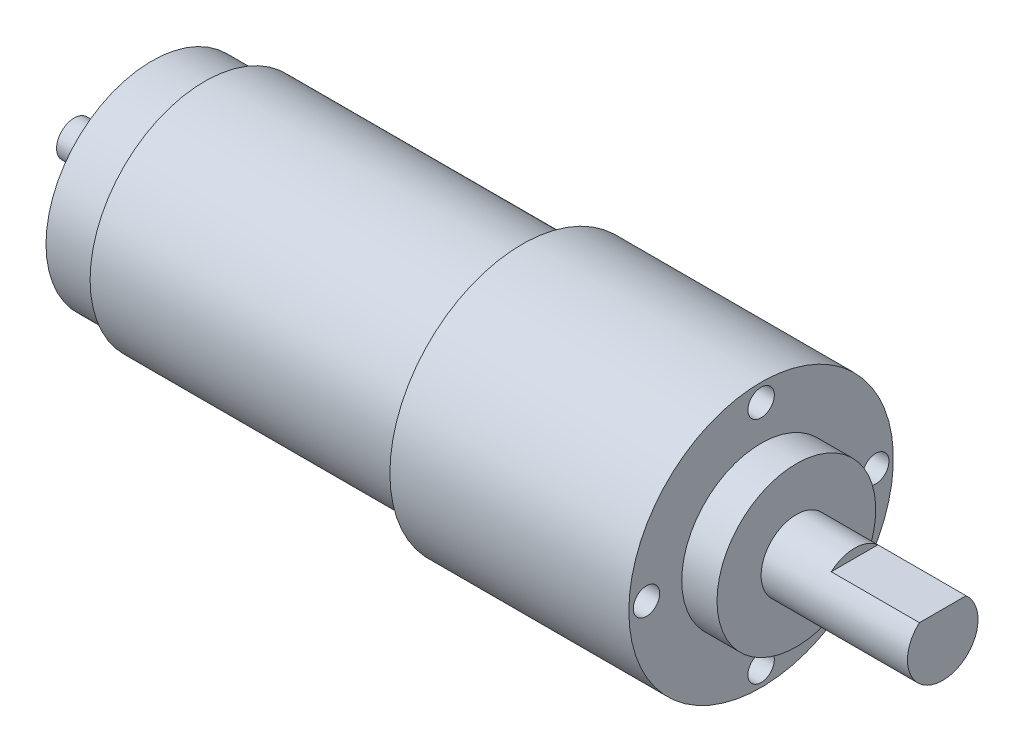
ISO-10303-21;
HEADER;
FILE_DESCRIPTION(('STEP AP214'),'2;1');
FILE_NAME('part.step','',(''),(''),'','','');
FILE_SCHEMA(('AUTOMOTIVE_DESIGN { 1 0 10303 214 1 1 1 1 }'));
ENDSEC;
DATA;
#1=APPLICATION_CONTEXT('core data for automotive mechanical design processes');
#2=APPLICATION_PROTOCOL_DEFINITION('international standard','automotive_design',2000,#1);
#3=PRODUCT_CONTEXT('',#1,'mechanical');
#4=PRODUCT('Part','Part','',(#3));
#5=PRODUCT_RELATED_PRODUCT_CATEGORY('part','',(#4));
#6=PRODUCT_DEFINITION_FORMATION('','',#4);
#7=PRODUCT_DEFINITION_CONTEXT('part definition',#1,'design');
#8=PRODUCT_DEFINITION('design','',#6,#7);
#9=PRODUCT_DEFINITION_SHAPE('','',#8);
#10=(LENGTH_UNIT() NAMED_UNIT(*) SI_UNIT(.MILLI.,.METRE.));
#11=(NAMED_UNIT(*) PLANE_ANGLE_UNIT() SI_UNIT($,.RADIAN.));
#12=(NAMED_UNIT(*) SI_UNIT($,.STERADIAN.) SOLID_ANGLE_UNIT());
#13=UNCERTAINTY_MEASURE_WITH_UNIT(LENGTH_MEASURE(1.E-05),#10,'distance_accuracy_value','');
#14=(GEOMETRIC_REPRESENTATION_CONTEXT(3) GLOBAL_UNCERTAINTY_ASSIGNED_CONTEXT((#13)) GLOBAL_UNIT_ASSIGNED_CONTEXT((#10,
#11,#12)) REPRESENTATION_CONTEXT('',''));
#15=CARTESIAN_POINT('',(0.,0.,0.));
#16=DIRECTION('',(0.,0.,1.));
#17=DIRECTION('',(1.,0.,0.));
#18=AXIS2_PLACEMENT_3D('',#15,#16,#17);
#19=CARTESIAN_POINT('',(0.,2.,0.));
#20=DIRECTION('',(1.,0.,0.));
#21=DIRECTION('',(0.,0.,-1.));
#22=AXIS2_PLACEMENT_3D('',#19,#20,#21);
#23=PLANE('',#22);
#24=CARTESIAN_POINT('',(0.,0.,0.));
#25=DIRECTION('',(-1.,0.,0.));
#26=DIRECTION('',(0.,0.,1.));
#27=AXIS2_PLACEMENT_3D('',#24,#25,#26);
#28=CIRCLE('',#27,2.);
#29=CARTESIAN_POINT('',(0.,0.,2.));
#30=VERTEX_POINT('',#29);
#31=EDGE_CURVE('E102',#30,#30,#28,.T.);
#32=ORIENTED_EDGE('',*,*,#31,.T.);
#33=EDGE_LOOP('',(#32));
#34=FACE_BOUND('',#33,.T.);
#35=ADVANCED_FACE('F32',(#34),#23,.F.);
#36=CARTESIAN_POINT('',(98.5,0.,0.));
#37=DIRECTION('',(-1.,0.,0.));
#38=DIRECTION('',(0.,0.,1.));
#39=AXIS2_PLACEMENT_3D('',#36,#37,#38);
#40=PLANE('',#39);
#41=CARTESIAN_POINT('',(98.5,0.,0.));
#42=DIRECTION('',(-1.,0.,0.));
#43=DIRECTION('',(0.,0.,1.));
#44=AXIS2_PLACEMENT_3D('',#41,#42,#43);
#45=CIRCLE('',#44,4.);
#46=CARTESIAN_POINT('',(98.5,3.,-2.64575131106459));
#47=VERTEX_POINT('',#46);
#48=CARTESIAN_POINT('',(98.5,3.,2.64575131106459));
#49=VERTEX_POINT('',#48);
#50=EDGE_CURVE('E39',#47,#49,#45,.T.);
#51=ORIENTED_EDGE('',*,*,#50,.F.);
#52=DIRECTION('',(0.,0.,-1.));
#53=VECTOR('',#52,1.);
#54=CARTESIAN_POINT('',(98.5,3.,2.64575131106459));
#55=LINE('',#54,#53);
#56=EDGE_CURVE('E58',#49,#47,#55,.T.);
#57=ORIENTED_EDGE('',*,*,#56,.F.);
#58=EDGE_LOOP('',(#51,#57));
#59=FACE_BOUND('',#58,.T.);
#60=ADVANCED_FACE('F66',(#59),#40,.F.);
#61=CARTESIAN_POINT('',(0.,0.,0.));
#62=DIRECTION('',(-1.,0.,0.));
#63=DIRECTION('',(0.,0.,1.));
#64=AXIS2_PLACEMENT_3D('',#61,#62,#63);
#65=CYLINDRICAL_SURFACE('',#64,4.);
#66=ORIENTED_EDGE('',*,*,#50,.T.);
#67=DIRECTION('',(1.,0.,0.));
#68=VECTOR('',#67,1.);
#69=CARTESIAN_POINT('',(88.5,3.,2.64575131106459));
#70=LINE('',#69,#68);
#71=CARTESIAN_POINT('',(88.5,3.,2.64575131106459));
#72=VERTEX_POINT('',#71);
#73=EDGE_CURVE('E55',#72,#49,#70,.T.);
#74=ORIENTED_EDGE('',*,*,#73,.F.);
#75=CARTESIAN_POINT('',(88.5,0.,0.));
#76=DIRECTION('',(-1.,0.,0.));
#77=DIRECTION('',(0.,0.,1.));
#78=AXIS2_PLACEMENT_3D('',#75,#76,#77);
#79=CIRCLE('',#78,4.);
#80=CARTESIAN_POINT('',(88.5,3.,-2.64575131106459));
#81=VERTEX_POINT('',#80);
#82=EDGE_CURVE('E11',#72,#81,#79,.T.);
#83=ORIENTED_EDGE('',*,*,#82,.T.);
#84=DIRECTION('',(1.,0.,0.));
#85=VECTOR('',#84,1.);
#86=CARTESIAN_POINT('',(88.5,3.,-2.64575131106459));
#87=LINE('',#86,#85);
#88=EDGE_CURVE('E62',#81,#47,#87,.T.);
#89=ORIENTED_EDGE('',*,*,#88,.T.);
#90=EDGE_LOOP('',(#66,#74,#83,#89));
#91=FACE_BOUND('',#90,.T.);
#92=CARTESIAN_POINT('',(81.9,0.,0.));
#93=DIRECTION('',(-1.,0.,0.));
#94=DIRECTION('',(0.,0.,1.));
#95=AXIS2_PLACEMENT_3D('',#92,#93,#94);
#96=CIRCLE('',#95,4.);
#97=CARTESIAN_POINT('',(81.9,0.,4.));
#98=VERTEX_POINT('',#97);
#99=EDGE_CURVE('E71',#98,#98,#96,.T.);
#100=ORIENTED_EDGE('',*,*,#99,.F.);
#101=EDGE_LOOP('',(#100));
#102=FACE_BOUND('',#101,.T.);
#103=ADVANCED_FACE('F69',(#91,#102),#65,.T.);
#104=CARTESIAN_POINT('',(81.9,4.,0.));
#105=DIRECTION('',(-1.,0.,0.));
#106=DIRECTION('',(0.,0.,1.));
#107=AXIS2_PLACEMENT_3D('',#104,#105,#106);
#108=PLANE('',#107);
#109=CARTESIAN_POINT('',(81.9,0.,0.));
#110=DIRECTION('',(-1.,0.,0.));
#111=DIRECTION('',(0.,0.,1.));
#112=AXIS2_PLACEMENT_3D('',#109,#110,#111);
#113=CIRCLE('',#112,9.);
#114=CARTESIAN_POINT('',(81.9,0.,9.));
#115=VERTEX_POINT('',#114);
#116=EDGE_CURVE('E73',#115,#115,#113,.T.);
#117=ORIENTED_EDGE('',*,*,#116,.F.);
#118=EDGE_LOOP('',(#117));
#119=FACE_BOUND('',#118,.T.);
#120=ORIENTED_EDGE('',*,*,#99,.T.);
#121=EDGE_LOOP('',(#120));
#122=FACE_BOUND('',#121,.T.);
#123=ADVANCED_FACE('F158',(#119,#122),#108,.F.);
#124=CARTESIAN_POINT('',(0.,0.,0.));
#125=DIRECTION('',(-1.,0.,0.));
#126=DIRECTION('',(0.,0.,1.));
#127=AXIS2_PLACEMENT_3D('',#124,#125,#126);
#128=CYLINDRICAL_SURFACE('',#127,9.);
#129=CARTESIAN_POINT('',(77.9,0.,0.));
#130=DIRECTION('',(-1.,0.,0.));
#131=DIRECTION('',(0.,0.,1.));
#132=AXIS2_PLACEMENT_3D('',#129,#130,#131);
#133=CIRCLE('',#132,9.);
#134=CARTESIAN_POINT('',(77.9,0.,9.));
#135=VERTEX_POINT('',#134);
#136=EDGE_CURVE('E78',#135,#135,#133,.T.);
#137=ORIENTED_EDGE('',*,*,#136,.F.);
#138=EDGE_LOOP('',(#137));
#139=FACE_BOUND('',#138,.T.);
#140=ORIENTED_EDGE('',*,*,#116,.T.);
#141=EDGE_LOOP('',(#140));
#142=FACE_BOUND('',#141,.T.);
#143=ADVANCED_FACE('F144',(#139,#142),#128,.T.);
#144=CARTESIAN_POINT('',(77.9,9.,0.));
#145=DIRECTION('',(-1.,0.,0.));
#146=DIRECTION('',(0.,0.,1.));
#147=AXIS2_PLACEMENT_3D('',#144,#145,#146);
#148=PLANE('',#147);
#149=CARTESIAN_POINT('',(77.9,1.36167772214882E-13,-13.));
#150=DIRECTION('',(1.,0.,0.));
#151=DIRECTION('',(0.,-1.,0.));
#152=AXIS2_PLACEMENT_3D('',#149,#150,#151);
#153=CIRCLE('',#152,1.5);
#154=CARTESIAN_POINT('',(77.9,-1.49999999999986,-13.));
#155=VERTEX_POINT('',#154);
#156=EDGE_CURVE('E125',#155,#155,#153,.T.);
#157=ORIENTED_EDGE('',*,*,#156,.F.);
#158=EDGE_LOOP('',(#157));
#159=FACE_BOUND('',#158,.T.);
#160=CARTESIAN_POINT('',(77.9,-13.,0.));
#161=DIRECTION('',(1.,0.,0.));
#162=DIRECTION('',(0.,0.,1.));
#163=AXIS2_PLACEMENT_3D('',#160,#161,#162);
#164=CIRCLE('',#163,1.5);
#165=CARTESIAN_POINT('',(77.9,-13.,1.5));
#166=VERTEX_POINT('',#165);
#167=EDGE_CURVE('E119',#166,#166,#164,.T.);
#168=ORIENTED_EDGE('',*,*,#167,.F.);
#169=EDGE_LOOP('',(#168));
#170=FACE_BOUND('',#169,.T.);
#171=CARTESIAN_POINT('',(77.9,0.,13.));
#172=DIRECTION('',(1.,0.,0.));
#173=DIRECTION('',(0.,1.,0.));
#174=AXIS2_PLACEMENT_3D('',#171,#172,#173);
#175=CIRCLE('',#174,1.5);
#176=CARTESIAN_POINT('',(77.9,1.49999999999995,13.));
#177=VERTEX_POINT('',#176);
#178=EDGE_CURVE('E113',#177,#177,#175,.T.);
#179=ORIENTED_EDGE('',*,*,#178,.F.);
#180=EDGE_LOOP('',(#179));
#181=FACE_BOUND('',#180,.T.);
#182=CARTESIAN_POINT('',(77.9,13.,0.));
#183=DIRECTION('',(1.,0.,0.));
#184=DIRECTION('',(0.,0.,-1.));
#185=AXIS2_PLACEMENT_3D('',#182,#183,#184);
#186=CIRCLE('',#185,1.5);
#187=CARTESIAN_POINT('',(77.9,13.,-1.5));
#188=VERTEX_POINT('',#187);
#189=EDGE_CURVE('E107',#188,#188,#186,.T.);
#190=ORIENTED_EDGE('',*,*,#189,.F.);
#191=EDGE_LOOP('',(#190));
#192=FACE_BOUND('',#191,.T.);
#193=CARTESIAN_POINT('',(77.9,0.,0.));
#194=DIRECTION('',(-1.,0.,0.));
#195=DIRECTION('',(0.,0.,1.));
#196=AXIS2_PLACEMENT_3D('',#193,#194,#195);
#197=CIRCLE('',#196,15.);
#198=CARTESIAN_POINT('',(77.9,0.,15.));
#199=VERTEX_POINT('',#198);
#200=EDGE_CURVE('E81',#199,#199,#197,.T.);
#201=ORIENTED_EDGE('',*,*,#200,.F.);
#202=EDGE_LOOP('',(#201));
#203=FACE_BOUND('',#202,.T.);
#204=ORIENTED_EDGE('',*,*,#136,.T.);
#205=EDGE_LOOP('',(#204));
#206=FACE_BOUND('',#205,.T.);
#207=ADVANCED_FACE('F140',(#159,#170,#181,#192,#203,#206),#148,.F.);
#208=CARTESIAN_POINT('',(0.,0.,0.));
#209=DIRECTION('',(-1.,0.,0.));
#210=DIRECTION('',(0.,0.,1.));
#211=AXIS2_PLACEMENT_3D('',#208,#209,#210);
#212=CYLINDRICAL_SURFACE('',#211,15.);
#213=CARTESIAN_POINT('',(50.8,0.,0.));
#214=DIRECTION('',(-1.,0.,0.));
#215=DIRECTION('',(0.,0.,1.));
#216=AXIS2_PLACEMENT_3D('',#213,#214,#215);
#217=CIRCLE('',#216,15.);
#218=CARTESIAN_POINT('',(50.8,0.,15.));
#219=VERTEX_POINT('',#218);
#220=EDGE_CURVE('E84',#219,#219,#217,.T.);
#221=ORIENTED_EDGE('',*,*,#220,.F.);
#222=EDGE_LOOP('',(#221));
#223=FACE_BOUND('',#222,.T.);
#224=ORIENTED_EDGE('',*,*,#200,.T.);
#225=EDGE_LOOP('',(#224));
#226=FACE_BOUND('',#225,.T.);
#227=ADVANCED_FACE('F143',(#223,#226),#212,.T.);
#228=CARTESIAN_POINT('',(50.8,15.,0.));
#229=DIRECTION('',(1.,0.,0.));
#230=DIRECTION('',(0.,0.,-1.));
#231=AXIS2_PLACEMENT_3D('',#228,#229,#230);
#232=PLANE('',#231);
#233=CARTESIAN_POINT('',(50.8,0.,0.));
#234=DIRECTION('',(-1.,0.,0.));
#235=DIRECTION('',(0.,0.,1.));
#236=AXIS2_PLACEMENT_3D('',#233,#234,#235);
#237=CIRCLE('',#236,13.);
#238=CARTESIAN_POINT('',(50.8,0.,13.));
#239=VERTEX_POINT('',#238);
#240=EDGE_CURVE('E87',#239,#239,#237,.T.);
#241=ORIENTED_EDGE('',*,*,#240,.F.);
#242=EDGE_LOOP('',(#241));
#243=FACE_BOUND('',#242,.T.);
#244=ORIENTED_EDGE('',*,*,#220,.T.);
#245=EDGE_LOOP('',(#244));
#246=FACE_BOUND('',#245,.T.);
#247=ADVANCED_FACE('F205',(#243,#246),#232,.F.);
#248=CARTESIAN_POINT('',(0.,0.,0.));
#249=DIRECTION('',(-1.,0.,0.));
#250=DIRECTION('',(0.,0.,1.));
#251=AXIS2_PLACEMENT_3D('',#248,#249,#250);
#252=CYLINDRICAL_SURFACE('',#251,13.);
#253=CARTESIAN_POINT('',(14.8,0.,0.));
#254=DIRECTION('',(-1.,0.,0.));
#255=DIRECTION('',(0.,0.,1.));
#256=AXIS2_PLACEMENT_3D('',#253,#254,#255);
#257=CIRCLE('',#256,13.);
#258=CARTESIAN_POINT('',(14.8,0.,13.));
#259=VERTEX_POINT('',#258);
#260=EDGE_CURVE('E90',#259,#259,#257,.T.);
#261=ORIENTED_EDGE('',*,*,#260,.F.);
#262=EDGE_LOOP('',(#261));
#263=FACE_BOUND('',#262,.T.);
#264=ORIENTED_EDGE('',*,*,#240,.T.);
#265=EDGE_LOOP('',(#264));
#266=FACE_BOUND('',#265,.T.);
#267=ADVANCED_FACE('F199',(#263,#266),#252,.T.);
#268=CARTESIAN_POINT('',(14.8,13.,0.));
#269=DIRECTION('',(1.,0.,0.));
#270=DIRECTION('',(0.,0.,-1.));
#271=AXIS2_PLACEMENT_3D('',#268,#269,#270);
#272=PLANE('',#271);
#273=CARTESIAN_POINT('',(14.8,0.,0.));
#274=DIRECTION('',(-1.,0.,0.));
#275=DIRECTION('',(0.,0.,1.));
#276=AXIS2_PLACEMENT_3D('',#273,#274,#275);
#277=CIRCLE('',#276,12.);
#278=CARTESIAN_POINT('',(14.8,0.,12.));
#279=VERTEX_POINT('',#278);
#280=EDGE_CURVE('E93',#279,#279,#277,.T.);
#281=ORIENTED_EDGE('',*,*,#280,.F.);
#282=EDGE_LOOP('',(#281));
#283=FACE_BOUND('',#282,.T.);
#284=ORIENTED_EDGE('',*,*,#260,.T.);
#285=EDGE_LOOP('',(#284));
#286=FACE_BOUND('',#285,.T.);
#287=ADVANCED_FACE('F193',(#283,#286),#272,.F.);
#288=CARTESIAN_POINT('',(0.,0.,0.));
#289=DIRECTION('',(-1.,0.,0.));
#290=DIRECTION('',(0.,0.,1.));
#291=AXIS2_PLACEMENT_3D('',#288,#289,#290);
#292=CYLINDRICAL_SURFACE('',#291,12.);
#293=CARTESIAN_POINT('',(8.8,0.,0.));
#294=DIRECTION('',(-1.,0.,0.));
#295=DIRECTION('',(0.,0.,1.));
#296=AXIS2_PLACEMENT_3D('',#293,#294,#295);
#297=CIRCLE('',#296,12.);
#298=CARTESIAN_POINT('',(8.8,0.,12.));
#299=VERTEX_POINT('',#298);
#300=EDGE_CURVE('E96',#299,#299,#297,.T.);
#301=ORIENTED_EDGE('',*,*,#300,.F.);
#302=EDGE_LOOP('',(#301));
#303=FACE_BOUND('',#302,.T.);
#304=ORIENTED_EDGE('',*,*,#280,.T.);
#305=EDGE_LOOP('',(#304));
#306=FACE_BOUND('',#305,.T.);
#307=ADVANCED_FACE('F187',(#303,#306),#292,.T.);
#308=CARTESIAN_POINT('',(8.8,12.,0.));
#309=DIRECTION('',(1.,0.,0.));
#310=DIRECTION('',(0.,0.,-1.));
#311=AXIS2_PLACEMENT_3D('',#308,#309,#310);
#312=PLANE('',#311);
#313=CARTESIAN_POINT('',(8.8,0.,0.));
#314=DIRECTION('',(-1.,0.,0.));
#315=DIRECTION('',(0.,0.,1.));
#316=AXIS2_PLACEMENT_3D('',#313,#314,#315);
#317=CIRCLE('',#316,2.);
#318=CARTESIAN_POINT('',(8.8,0.,2.));
#319=VERTEX_POINT('',#318);
#320=EDGE_CURVE('E99',#319,#319,#317,.T.);
#321=ORIENTED_EDGE('',*,*,#320,.F.);
#322=EDGE_LOOP('',(#321));
#323=FACE_BOUND('',#322,.T.);
#324=ORIENTED_EDGE('',*,*,#300,.T.);
#325=EDGE_LOOP('',(#324));
#326=FACE_BOUND('',#325,.T.);
#327=ADVANCED_FACE('F181',(#323,#326),#312,.F.);
#328=CARTESIAN_POINT('',(0.,0.,0.));
#329=DIRECTION('',(-1.,0.,0.));
#330=DIRECTION('',(0.,0.,1.));
#331=AXIS2_PLACEMENT_3D('',#328,#329,#330);
#332=CYLINDRICAL_SURFACE('',#331,2.);
#333=ORIENTED_EDGE('',*,*,#31,.F.);
#334=EDGE_LOOP('',(#333));
#335=FACE_BOUND('',#334,.T.);
#336=ORIENTED_EDGE('',*,*,#320,.T.);
#337=EDGE_LOOP('',(#336));
#338=FACE_BOUND('',#337,.T.);
#339=ADVANCED_FACE('F177',(#335,#338),#332,.T.);
#340=CARTESIAN_POINT('',(88.5,0.,0.));
#341=DIRECTION('',(-1.,0.,0.));
#342=DIRECTION('',(0.,0.,1.));
#343=AXIS2_PLACEMENT_3D('',#340,#341,#342);
#344=PLANE('',#343);
#345=DIRECTION('',(0.,0.,-1.));
#346=VECTOR('',#345,1.);
#347=CARTESIAN_POINT('',(88.5,3.,2.64575131106459));
#348=LINE('',#347,#346);
#349=EDGE_CURVE('E45',#72,#81,#348,.T.);
#350=ORIENTED_EDGE('',*,*,#349,.T.);
#351=ORIENTED_EDGE('',*,*,#82,.F.);
#352=EDGE_LOOP('',(#350,#351));
#353=FACE_BOUND('',#352,.T.);
#354=ADVANCED_FACE('F180',(#353),#344,.F.);
#355=CARTESIAN_POINT('',(88.5,3.,2.64575131106459));
#356=DIRECTION('',(0.,-1.,0.));
#357=DIRECTION('',(0.,0.,-1.));
#358=AXIS2_PLACEMENT_3D('',#355,#356,#357);
#359=PLANE('',#358);
#360=ORIENTED_EDGE('',*,*,#56,.T.);
#361=ORIENTED_EDGE('',*,*,#88,.F.);
#362=ORIENTED_EDGE('',*,*,#349,.F.);
#363=ORIENTED_EDGE('',*,*,#73,.T.);
#364=EDGE_LOOP('',(#360,#361,#362,#363));
#365=FACE_BOUND('',#364,.T.);
#366=ADVANCED_FACE('F57',(#365),#359,.F.);
#367=CARTESIAN_POINT('',(74.9,13.,0.));
#368=DIRECTION('',(1.,0.,0.));
#369=DIRECTION('',(0.,0.,-1.));
#370=AXIS2_PLACEMENT_3D('',#367,#368,#369);
#371=CYLINDRICAL_SURFACE('',#370,1.5);
#372=CARTESIAN_POINT('',(74.9,13.,0.));
#373=DIRECTION('',(1.,0.,0.));
#374=DIRECTION('',(0.,0.,-1.));
#375=AXIS2_PLACEMENT_3D('',#372,#373,#374);
#376=CIRCLE('',#375,1.5);
#377=CARTESIAN_POINT('',(74.9,13.,-1.5));
#378=VERTEX_POINT('',#377);
#379=EDGE_CURVE('E67',#378,#378,#376,.T.);
#380=ORIENTED_EDGE('',*,*,#379,.F.);
#381=EDGE_LOOP('',(#380));
#382=FACE_BOUND('',#381,.T.);
#383=ORIENTED_EDGE('',*,*,#189,.T.);
#384=EDGE_LOOP('',(#383));
#385=FACE_BOUND('',#384,.T.);
#386=ADVANCED_FACE('F222',(#382,#385),#371,.F.);
#387=CARTESIAN_POINT('',(74.9,13.,0.));
#388=DIRECTION('',(1.,0.,0.));
#389=DIRECTION('',(0.,0.,-1.));
#390=AXIS2_PLACEMENT_3D('',#387,#388,#389);
#391=PLANE('',#390);
#392=ORIENTED_EDGE('',*,*,#379,.T.);
#393=EDGE_LOOP('',(#392));
#394=FACE_BOUND('',#393,.T.);
#395=ADVANCED_FACE('F227',(#394),#391,.T.);
#396=CARTESIAN_POINT('',(74.9,0.,13.));
#397=DIRECTION('',(1.,0.,0.));
#398=DIRECTION('',(0.,0.,-1.));
#399=AXIS2_PLACEMENT_3D('',#396,#397,#398);
#400=CYLINDRICAL_SURFACE('',#399,1.5);
#401=CARTESIAN_POINT('',(74.9,0.,13.));
#402=DIRECTION('',(1.,0.,0.));
#403=DIRECTION('',(0.,1.,0.));
#404=AXIS2_PLACEMENT_3D('',#401,#402,#403);
#405=CIRCLE('',#404,1.5);
#406=CARTESIAN_POINT('',(74.9,1.49999999999995,13.));
#407=VERTEX_POINT('',#406);
#408=EDGE_CURVE('E110',#407,#407,#405,.T.);
#409=ORIENTED_EDGE('',*,*,#408,.F.);
#410=EDGE_LOOP('',(#409));
#411=FACE_BOUND('',#410,.T.);
#412=ORIENTED_EDGE('',*,*,#178,.T.);
#413=EDGE_LOOP('',(#412));
#414=FACE_BOUND('',#413,.T.);
#415=ADVANCED_FACE('F231',(#411,#414),#400,.F.);
#416=CARTESIAN_POINT('',(74.9,0.,13.));
#417=DIRECTION('',(1.,0.,0.));
#418=DIRECTION('',(0.,1.,0.));
#419=AXIS2_PLACEMENT_3D('',#416,#417,#418);
#420=PLANE('',#419);
#421=ORIENTED_EDGE('',*,*,#408,.T.);
#422=EDGE_LOOP('',(#421));
#423=FACE_BOUND('',#422,.T.);
#424=ADVANCED_FACE('F235',(#423),#420,.T.);
#425=CARTESIAN_POINT('',(74.9,-13.,0.));
#426=DIRECTION('',(1.,0.,0.));
#427=DIRECTION('',(0.,0.,-1.));
#428=AXIS2_PLACEMENT_3D('',#425,#426,#427);
#429=CYLINDRICAL_SURFACE('',#428,1.5);
#430=CARTESIAN_POINT('',(74.9,-13.,0.));
#431=DIRECTION('',(1.,0.,0.));
#432=DIRECTION('',(0.,0.,1.));
#433=AXIS2_PLACEMENT_3D('',#430,#431,#432);
#434=CIRCLE('',#433,1.5);
#435=CARTESIAN_POINT('',(74.9,-13.,1.5));
#436=VERTEX_POINT('',#435);
#437=EDGE_CURVE('E116',#436,#436,#434,.T.);
#438=ORIENTED_EDGE('',*,*,#437,.F.);
#439=EDGE_LOOP('',(#438));
#440=FACE_BOUND('',#439,.T.);
#441=ORIENTED_EDGE('',*,*,#167,.T.);
#442=EDGE_LOOP('',(#441));
#443=FACE_BOUND('',#442,.T.);
#444=ADVANCED_FACE('F239',(#440,#443),#429,.F.);
#445=CARTESIAN_POINT('',(74.9,-13.,0.));
#446=DIRECTION('',(1.,0.,0.));
#447=DIRECTION('',(0.,0.,1.));
#448=AXIS2_PLACEMENT_3D('',#445,#446,#447);
#449=PLANE('',#448);
#450=ORIENTED_EDGE('',*,*,#437,.T.);
#451=EDGE_LOOP('',(#450));
#452=FACE_BOUND('',#451,.T.);
#453=ADVANCED_FACE('F136',(#452),#449,.T.);
#454=CARTESIAN_POINT('',(74.9,1.36167772214882E-13,-13.));
#455=DIRECTION('',(1.,0.,0.));
#456=DIRECTION('',(0.,0.,-1.));
#457=AXIS2_PLACEMENT_3D('',#454,#455,#456);
#458=CYLINDRICAL_SURFACE('',#457,1.5);
#459=CARTESIAN_POINT('',(74.9,1.36167772214882E-13,-13.));
#460=DIRECTION('',(1.,0.,0.));
#461=DIRECTION('',(0.,-1.,0.));
#462=AXIS2_PLACEMENT_3D('',#459,#460,#461);
#463=CIRCLE('',#462,1.5);
#464=CARTESIAN_POINT('',(74.9,-1.49999999999986,-13.));
#465=VERTEX_POINT('',#464);
#466=EDGE_CURVE('E122',#465,#465,#463,.T.);
#467=ORIENTED_EDGE('',*,*,#466,.F.);
#468=EDGE_LOOP('',(#467));
#469=FACE_BOUND('',#468,.T.);
#470=ORIENTED_EDGE('',*,*,#156,.T.);
#471=EDGE_LOOP('',(#470));
#472=FACE_BOUND('',#471,.T.);
#473=ADVANCED_FACE('F133',(#469,#472),#458,.F.);
#474=CARTESIAN_POINT('',(74.9,1.36167772214882E-13,-13.));
#475=DIRECTION('',(1.,0.,0.));
#476=DIRECTION('',(0.,-1.,0.));
#477=AXIS2_PLACEMENT_3D('',#474,#475,#476);
#478=PLANE('',#477);
#479=ORIENTED_EDGE('',*,*,#466,.T.);
#480=EDGE_LOOP('',(#479));
#481=FACE_BOUND('',#480,.T.);
#482=ADVANCED_FACE('F131',(#481),#478,.T.);
#483=CLOSED_SHELL('',(#35,#60,#103,#123,#143,#207,#227,#247,#267,#287,#307,#327,#339,#354,#366,
#386,#395,#415,#424,#444,#453,#473,#482));
#484=MANIFOLD_SOLID_BREP('B2',#483);
#485=ADVANCED_BREP_SHAPE_REPRESENTATION('',(#18,#484),#14);
#486=SHAPE_DEFINITION_REPRESENTATION(#9,#485);
ENDSEC;
END-ISO-10303-21;
